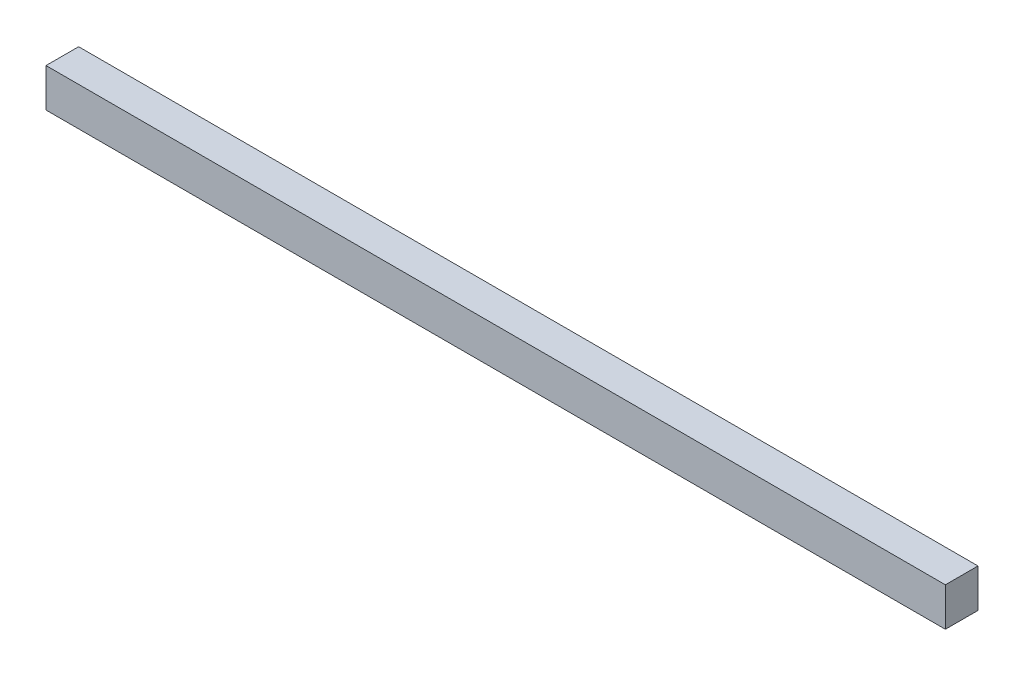
ISO-10303-21;
HEADER;
FILE_DESCRIPTION(('STEP AP214'),'2;1');
FILE_NAME('part.step','',(''),(''),'','','');
FILE_SCHEMA(('AUTOMOTIVE_DESIGN { 1 0 10303 214 1 1 1 1 }'));
ENDSEC;
DATA;
#1=APPLICATION_CONTEXT('core data for automotive mechanical design processes');
#2=APPLICATION_PROTOCOL_DEFINITION('international standard','automotive_design',2000,#1);
#3=PRODUCT_CONTEXT('',#1,'mechanical');
#4=PRODUCT('Part','Part','',(#3));
#5=PRODUCT_RELATED_PRODUCT_CATEGORY('part','',(#4));
#6=PRODUCT_DEFINITION_FORMATION('','',#4);
#7=PRODUCT_DEFINITION_CONTEXT('part definition',#1,'design');
#8=PRODUCT_DEFINITION('design','',#6,#7);
#9=PRODUCT_DEFINITION_SHAPE('','',#8);
#10=(LENGTH_UNIT() NAMED_UNIT(*) SI_UNIT(.MILLI.,.METRE.));
#11=(NAMED_UNIT(*) PLANE_ANGLE_UNIT() SI_UNIT($,.RADIAN.));
#12=(NAMED_UNIT(*) SI_UNIT($,.STERADIAN.) SOLID_ANGLE_UNIT());
#13=UNCERTAINTY_MEASURE_WITH_UNIT(LENGTH_MEASURE(1.E-05),#10,'distance_accuracy_value','');
#14=(GEOMETRIC_REPRESENTATION_CONTEXT(3) GLOBAL_UNCERTAINTY_ASSIGNED_CONTEXT((#13)) GLOBAL_UNIT_ASSIGNED_CONTEXT((#10,
#11,#12)) REPRESENTATION_CONTEXT('',''));
#15=CARTESIAN_POINT('',(0.,0.,0.));
#16=DIRECTION('',(0.,0.,1.));
#17=DIRECTION('',(1.,0.,0.));
#18=AXIS2_PLACEMENT_3D('',#15,#16,#17);
#19=CARTESIAN_POINT('',(0.,0.,2.54));
#20=DIRECTION('',(1.,0.,0.));
#21=DIRECTION('',(0.,1.,0.));
#22=AXIS2_PLACEMENT_3D('',#19,#20,#21);
#23=PLANE('',#22);
#24=DIRECTION('',(0.,-1.,0.));
#25=VECTOR('',#24,1.);
#26=CARTESIAN_POINT('',(0.,0.,0.));
#27=LINE('',#26,#25);
#28=CARTESIAN_POINT('',(0.,0.,0.));
#29=VERTEX_POINT('',#28);
#30=CARTESIAN_POINT('',(0.,-3.,0.));
#31=VERTEX_POINT('',#30);
#32=EDGE_CURVE('E75',#29,#31,#27,.T.);
#33=ORIENTED_EDGE('',*,*,#32,.T.);
#34=DIRECTION('',(0.,0.,-1.));
#35=VECTOR('',#34,1.);
#36=CARTESIAN_POINT('',(0.,-3.,2.54));
#37=LINE('',#36,#35);
#38=CARTESIAN_POINT('',(0.,-3.,2.54));
#39=VERTEX_POINT('',#38);
#40=EDGE_CURVE('E11',#39,#31,#37,.T.);
#41=ORIENTED_EDGE('',*,*,#40,.F.);
#42=DIRECTION('',(0.,-1.,0.));
#43=VECTOR('',#42,1.);
#44=CARTESIAN_POINT('',(0.,0.,2.54));
#45=LINE('',#44,#43);
#46=CARTESIAN_POINT('',(0.,0.,2.54));
#47=VERTEX_POINT('',#46);
#48=EDGE_CURVE('E93',#47,#39,#45,.T.);
#49=ORIENTED_EDGE('',*,*,#48,.F.);
#50=DIRECTION('',(0.,0.,-1.));
#51=VECTOR('',#50,1.);
#52=CARTESIAN_POINT('',(0.,0.,2.54));
#53=LINE('',#52,#51);
#54=EDGE_CURVE('E87',#47,#29,#53,.T.);
#55=ORIENTED_EDGE('',*,*,#54,.T.);
#56=EDGE_LOOP('',(#33,#41,#49,#55));
#57=FACE_BOUND('',#56,.T.);
#58=ADVANCED_FACE('F31',(#57),#23,.F.);
#59=CARTESIAN_POINT('',(0.,-3.,2.54));
#60=DIRECTION('',(0.,1.,0.));
#61=DIRECTION('',(0.,0.,1.));
#62=AXIS2_PLACEMENT_3D('',#59,#60,#61);
#63=PLANE('',#62);
#64=DIRECTION('',(1.,0.,0.));
#65=VECTOR('',#64,1.);
#66=CARTESIAN_POINT('',(0.,-3.,0.));
#67=LINE('',#66,#65);
#68=CARTESIAN_POINT('',(70.,-3.,0.));
#69=VERTEX_POINT('',#68);
#70=EDGE_CURVE('E71',#31,#69,#67,.T.);
#71=ORIENTED_EDGE('',*,*,#70,.T.);
#72=DIRECTION('',(0.,0.,-1.));
#73=VECTOR('',#72,1.);
#74=CARTESIAN_POINT('',(70.,-3.,2.54));
#75=LINE('',#74,#73);
#76=CARTESIAN_POINT('',(70.,-3.,2.54));
#77=VERTEX_POINT('',#76);
#78=EDGE_CURVE('E38',#77,#69,#75,.T.);
#79=ORIENTED_EDGE('',*,*,#78,.F.);
#80=DIRECTION('',(1.,0.,0.));
#81=VECTOR('',#80,1.);
#82=CARTESIAN_POINT('',(0.,-3.,2.54));
#83=LINE('',#82,#81);
#84=EDGE_CURVE('E83',#39,#77,#83,.T.);
#85=ORIENTED_EDGE('',*,*,#84,.F.);
#86=ORIENTED_EDGE('',*,*,#40,.T.);
#87=EDGE_LOOP('',(#71,#79,#85,#86));
#88=FACE_BOUND('',#87,.T.);
#89=ADVANCED_FACE('F82',(#88),#63,.F.);
#90=CARTESIAN_POINT('',(70.,0.,2.54));
#91=DIRECTION('',(-1.,0.,0.));
#92=DIRECTION('',(0.,0.,1.));
#93=AXIS2_PLACEMENT_3D('',#90,#91,#92);
#94=PLANE('',#93);
#95=DIRECTION('',(0.,1.,0.));
#96=VECTOR('',#95,1.);
#97=CARTESIAN_POINT('',(70.,0.,0.));
#98=LINE('',#97,#96);
#99=CARTESIAN_POINT('',(70.,0.,0.));
#100=VERTEX_POINT('',#99);
#101=EDGE_CURVE('E76',#69,#100,#98,.T.);
#102=ORIENTED_EDGE('',*,*,#101,.T.);
#103=DIRECTION('',(0.,0.,-1.));
#104=VECTOR('',#103,1.);
#105=CARTESIAN_POINT('',(70.,0.,2.54));
#106=LINE('',#105,#104);
#107=CARTESIAN_POINT('',(70.,0.,2.54));
#108=VERTEX_POINT('',#107);
#109=EDGE_CURVE('E99',#108,#100,#106,.T.);
#110=ORIENTED_EDGE('',*,*,#109,.F.);
#111=DIRECTION('',(0.,1.,0.));
#112=VECTOR('',#111,1.);
#113=CARTESIAN_POINT('',(70.,0.,2.54));
#114=LINE('',#113,#112);
#115=EDGE_CURVE('E50',#77,#108,#114,.T.);
#116=ORIENTED_EDGE('',*,*,#115,.F.);
#117=ORIENTED_EDGE('',*,*,#78,.T.);
#118=EDGE_LOOP('',(#102,#110,#116,#117));
#119=FACE_BOUND('',#118,.T.);
#120=ADVANCED_FACE('F102',(#119),#94,.F.);
#121=CARTESIAN_POINT('',(0.,0.,2.54));
#122=DIRECTION('',(0.,-1.,0.));
#123=DIRECTION('',(0.,0.,-1.));
#124=AXIS2_PLACEMENT_3D('',#121,#122,#123);
#125=PLANE('',#124);
#126=DIRECTION('',(-1.,0.,0.));
#127=VECTOR('',#126,1.);
#128=CARTESIAN_POINT('',(0.,0.,0.));
#129=LINE('',#128,#127);
#130=EDGE_CURVE('E91',#100,#29,#129,.T.);
#131=ORIENTED_EDGE('',*,*,#130,.T.);
#132=ORIENTED_EDGE('',*,*,#54,.F.);
#133=DIRECTION('',(-1.,0.,0.));
#134=VECTOR('',#133,1.);
#135=CARTESIAN_POINT('',(0.,0.,2.54));
#136=LINE('',#135,#134);
#137=EDGE_CURVE('E45',#108,#47,#136,.T.);
#138=ORIENTED_EDGE('',*,*,#137,.F.);
#139=ORIENTED_EDGE('',*,*,#109,.T.);
#140=EDGE_LOOP('',(#131,#132,#138,#139));
#141=FACE_BOUND('',#140,.T.);
#142=ADVANCED_FACE('F104',(#141),#125,.F.);
#143=CARTESIAN_POINT('',(0.,-3.,2.54));
#144=DIRECTION('',(0.,0.,1.));
#145=DIRECTION('',(1.,0.,0.));
#146=AXIS2_PLACEMENT_3D('',#143,#144,#145);
#147=PLANE('',#146);
#148=ORIENTED_EDGE('',*,*,#48,.T.);
#149=ORIENTED_EDGE('',*,*,#84,.T.);
#150=ORIENTED_EDGE('',*,*,#115,.T.);
#151=ORIENTED_EDGE('',*,*,#137,.T.);
#152=EDGE_LOOP('',(#148,#149,#150,#151));
#153=FACE_BOUND('',#152,.T.);
#154=ADVANCED_FACE('F105',(#153),#147,.T.);
#155=CARTESIAN_POINT('',(0.,-3.,0.));
#156=DIRECTION('',(0.,0.,1.));
#157=DIRECTION('',(1.,0.,0.));
#158=AXIS2_PLACEMENT_3D('',#155,#156,#157);
#159=PLANE('',#158);
#160=ORIENTED_EDGE('',*,*,#32,.F.);
#161=ORIENTED_EDGE('',*,*,#130,.F.);
#162=ORIENTED_EDGE('',*,*,#101,.F.);
#163=ORIENTED_EDGE('',*,*,#70,.F.);
#164=EDGE_LOOP('',(#160,#161,#162,#163));
#165=FACE_BOUND('',#164,.T.);
#166=ADVANCED_FACE('F72',(#165),#159,.F.);
#167=CLOSED_SHELL('',(#58,#89,#120,#142,#154,#166));
#168=MANIFOLD_SOLID_BREP('B2',#167);
#169=ADVANCED_BREP_SHAPE_REPRESENTATION('',(#18,#168),#14);
#170=SHAPE_DEFINITION_REPRESENTATION(#9,#169);
ENDSEC;
END-ISO-10303-21;
